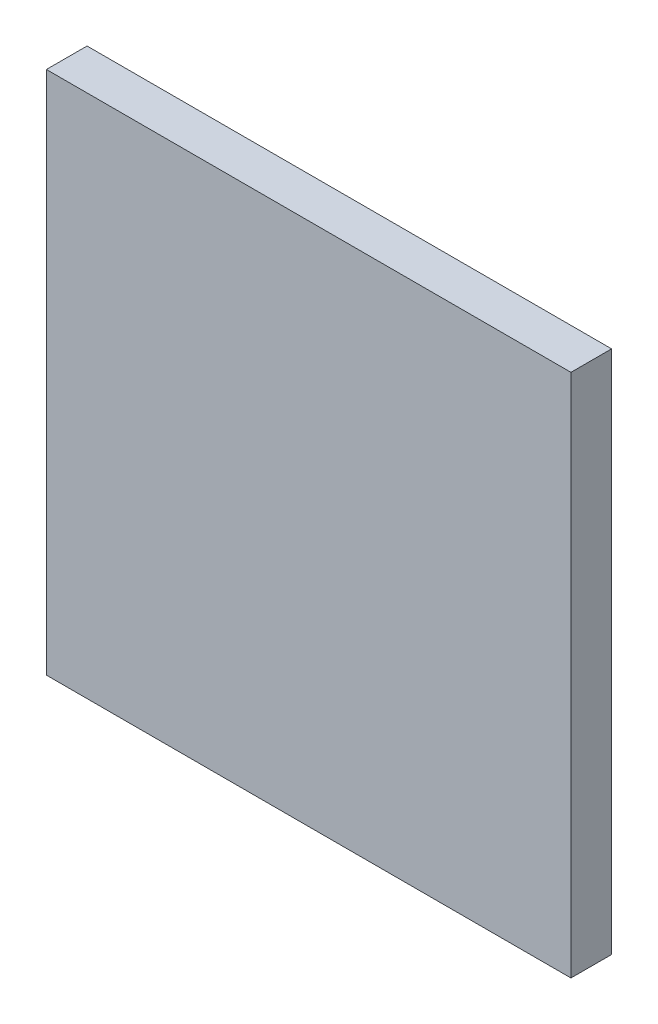
ISO-10303-21;
HEADER;
FILE_DESCRIPTION(('STEP AP214'),'2;1');
FILE_NAME('part.step','',(''),(''),'','','');
FILE_SCHEMA(('AUTOMOTIVE_DESIGN { 1 0 10303 214 1 1 1 1 }'));
ENDSEC;
DATA;
#1=APPLICATION_CONTEXT('core data for automotive mechanical design processes');
#2=APPLICATION_PROTOCOL_DEFINITION('international standard','automotive_design',2000,#1);
#3=PRODUCT_CONTEXT('',#1,'mechanical');
#4=PRODUCT('Part','Part','',(#3));
#5=PRODUCT_RELATED_PRODUCT_CATEGORY('part','',(#4));
#6=PRODUCT_DEFINITION_FORMATION('','',#4);
#7=PRODUCT_DEFINITION_CONTEXT('part definition',#1,'design');
#8=PRODUCT_DEFINITION('design','',#6,#7);
#9=PRODUCT_DEFINITION_SHAPE('','',#8);
#10=(LENGTH_UNIT() NAMED_UNIT(*) SI_UNIT(.MILLI.,.METRE.));
#11=(NAMED_UNIT(*) PLANE_ANGLE_UNIT() SI_UNIT($,.RADIAN.));
#12=(NAMED_UNIT(*) SI_UNIT($,.STERADIAN.) SOLID_ANGLE_UNIT());
#13=UNCERTAINTY_MEASURE_WITH_UNIT(LENGTH_MEASURE(1.E-05),#10,'distance_accuracy_value','');
#14=(GEOMETRIC_REPRESENTATION_CONTEXT(3) GLOBAL_UNCERTAINTY_ASSIGNED_CONTEXT((#13)) GLOBAL_UNIT_ASSIGNED_CONTEXT((#10,
#11,#12)) REPRESENTATION_CONTEXT('',''));
#15=CARTESIAN_POINT('',(0.,0.,0.));
#16=DIRECTION('',(0.,0.,1.));
#17=DIRECTION('',(1.,0.,0.));
#18=AXIS2_PLACEMENT_3D('',#15,#16,#17);
#19=CARTESIAN_POINT('',(-10.00000032,-10.00000032,1.54999944));
#20=DIRECTION('',(0.,0.,1.));
#21=DIRECTION('',(1.,0.,0.));
#22=AXIS2_PLACEMENT_3D('',#19,#20,#21);
#23=PLANE('',#22);
#24=DIRECTION('',(1.,0.,0.));
#25=VECTOR('',#24,1.);
#26=CARTESIAN_POINT('',(-10.00000032,10.00000032,1.54999944));
#27=LINE('',#26,#25);
#28=CARTESIAN_POINT('',(-10.00000032,10.00000032,1.54999944));
#29=VERTEX_POINT('',#28);
#30=CARTESIAN_POINT('',(10.00000032,10.00000032,1.54999944));
#31=VERTEX_POINT('',#30);
#32=EDGE_CURVE('E53',#29,#31,#27,.T.);
#33=ORIENTED_EDGE('',*,*,#32,.F.);
#34=DIRECTION('',(0.,1.,0.));
#35=VECTOR('',#34,1.);
#36=CARTESIAN_POINT('',(-10.00000032,-10.00000032,1.54999944));
#37=LINE('',#36,#35);
#38=CARTESIAN_POINT('',(-10.00000032,-10.00000032,1.54999944));
#39=VERTEX_POINT('',#38);
#40=EDGE_CURVE('E68',#39,#29,#37,.T.);
#41=ORIENTED_EDGE('',*,*,#40,.F.);
#42=DIRECTION('',(1.,0.,0.));
#43=VECTOR('',#42,1.);
#44=CARTESIAN_POINT('',(10.00000032,-10.00000032,1.54999944));
#45=LINE('',#44,#43);
#46=CARTESIAN_POINT('',(10.00000032,-10.00000032,1.54999944));
#47=VERTEX_POINT('',#46);
#48=EDGE_CURVE('E20',#47,#39,#45,.F.);
#49=ORIENTED_EDGE('',*,*,#48,.F.);
#50=DIRECTION('',(0.,1.,0.));
#51=VECTOR('',#50,1.);
#52=CARTESIAN_POINT('',(10.00000032,10.00000032,1.54999944));
#53=LINE('',#52,#51);
#54=EDGE_CURVE('E58',#31,#47,#53,.F.);
#55=ORIENTED_EDGE('',*,*,#54,.F.);
#56=EDGE_LOOP('',(#33,#41,#49,#55));
#57=FACE_BOUND('',#56,.T.);
#58=ADVANCED_FACE('F17',(#57),#23,.T.);
#59=CARTESIAN_POINT('',(10.00000032,-10.00000032,0.));
#60=DIRECTION('',(0.,-1.,0.));
#61=DIRECTION('',(0.,0.,-1.));
#62=AXIS2_PLACEMENT_3D('',#59,#60,#61);
#63=PLANE('',#62);
#64=DIRECTION('',(0.,0.,1.));
#65=VECTOR('',#64,1.);
#66=CARTESIAN_POINT('',(-10.00000032,-10.00000032,0.));
#67=LINE('',#66,#65);
#68=CARTESIAN_POINT('',(-10.00000032,-10.00000032,0.));
#69=VERTEX_POINT('',#68);
#70=EDGE_CURVE('E79',#69,#39,#67,.T.);
#71=ORIENTED_EDGE('',*,*,#70,.F.);
#72=DIRECTION('',(1.,0.,0.));
#73=VECTOR('',#72,1.);
#74=CARTESIAN_POINT('',(-10.00000032,-10.00000032,0.));
#75=LINE('',#74,#73);
#76=CARTESIAN_POINT('',(10.00000032,-10.00000032,0.));
#77=VERTEX_POINT('',#76);
#78=EDGE_CURVE('E74',#69,#77,#75,.T.);
#79=ORIENTED_EDGE('',*,*,#78,.T.);
#80=DIRECTION('',(0.,0.,-1.));
#81=VECTOR('',#80,1.);
#82=CARTESIAN_POINT('',(10.00000032,-10.00000032,0.));
#83=LINE('',#82,#81);
#84=EDGE_CURVE('E63',#47,#77,#83,.T.);
#85=ORIENTED_EDGE('',*,*,#84,.F.);
#86=ORIENTED_EDGE('',*,*,#48,.T.);
#87=EDGE_LOOP('',(#71,#79,#85,#86));
#88=FACE_BOUND('',#87,.T.);
#89=ADVANCED_FACE('F73',(#88),#63,.T.);
#90=CARTESIAN_POINT('',(10.00000032,10.00000032,0.));
#91=DIRECTION('',(1.,0.,0.));
#92=DIRECTION('',(0.,0.,-1.));
#93=AXIS2_PLACEMENT_3D('',#90,#91,#92);
#94=PLANE('',#93);
#95=ORIENTED_EDGE('',*,*,#84,.T.);
#96=DIRECTION('',(0.,1.,0.));
#97=VECTOR('',#96,1.);
#98=CARTESIAN_POINT('',(10.00000032,-10.00000032,0.));
#99=LINE('',#98,#97);
#100=CARTESIAN_POINT('',(10.00000032,10.00000032,0.));
#101=VERTEX_POINT('',#100);
#102=EDGE_CURVE('E84',#77,#101,#99,.T.);
#103=ORIENTED_EDGE('',*,*,#102,.T.);
#104=DIRECTION('',(0.,0.,1.));
#105=VECTOR('',#104,1.);
#106=CARTESIAN_POINT('',(10.00000032,10.00000032,0.));
#107=LINE('',#106,#105);
#108=EDGE_CURVE('E65',#31,#101,#107,.F.);
#109=ORIENTED_EDGE('',*,*,#108,.F.);
#110=ORIENTED_EDGE('',*,*,#54,.T.);
#111=EDGE_LOOP('',(#95,#103,#109,#110));
#112=FACE_BOUND('',#111,.T.);
#113=ADVANCED_FACE('F60',(#112),#94,.T.);
#114=CARTESIAN_POINT('',(-10.00000032,10.00000032,0.));
#115=DIRECTION('',(0.,1.,0.));
#116=DIRECTION('',(0.,0.,1.));
#117=AXIS2_PLACEMENT_3D('',#114,#115,#116);
#118=PLANE('',#117);
#119=ORIENTED_EDGE('',*,*,#108,.T.);
#120=DIRECTION('',(1.,0.,0.));
#121=VECTOR('',#120,1.);
#122=CARTESIAN_POINT('',(-10.00000032,10.00000032,0.));
#123=LINE('',#122,#121);
#124=CARTESIAN_POINT('',(-10.00000032,10.00000032,0.));
#125=VERTEX_POINT('',#124);
#126=EDGE_CURVE('E26',#101,#125,#123,.F.);
#127=ORIENTED_EDGE('',*,*,#126,.T.);
#128=DIRECTION('',(0.,0.,1.));
#129=VECTOR('',#128,1.);
#130=CARTESIAN_POINT('',(-10.00000032,10.00000032,0.));
#131=LINE('',#130,#129);
#132=EDGE_CURVE('E34',#29,#125,#131,.F.);
#133=ORIENTED_EDGE('',*,*,#132,.F.);
#134=ORIENTED_EDGE('',*,*,#32,.T.);
#135=EDGE_LOOP('',(#119,#127,#133,#134));
#136=FACE_BOUND('',#135,.T.);
#137=ADVANCED_FACE('F88',(#136),#118,.T.);
#138=CARTESIAN_POINT('',(-10.00000032,-10.00000032,0.));
#139=DIRECTION('',(-1.,0.,0.));
#140=DIRECTION('',(0.,0.,1.));
#141=AXIS2_PLACEMENT_3D('',#138,#139,#140);
#142=PLANE('',#141);
#143=ORIENTED_EDGE('',*,*,#132,.T.);
#144=DIRECTION('',(0.,1.,0.));
#145=VECTOR('',#144,1.);
#146=CARTESIAN_POINT('',(-10.00000032,-10.00000032,0.));
#147=LINE('',#146,#145);
#148=EDGE_CURVE('E11',#125,#69,#147,.F.);
#149=ORIENTED_EDGE('',*,*,#148,.T.);
#150=ORIENTED_EDGE('',*,*,#70,.T.);
#151=ORIENTED_EDGE('',*,*,#40,.T.);
#152=EDGE_LOOP('',(#143,#149,#150,#151));
#153=FACE_BOUND('',#152,.T.);
#154=ADVANCED_FACE('F91',(#153),#142,.T.);
#155=CARTESIAN_POINT('',(-10.00000032,-10.00000032,0.));
#156=DIRECTION('',(0.,0.,1.));
#157=DIRECTION('',(1.,0.,0.));
#158=AXIS2_PLACEMENT_3D('',#155,#156,#157);
#159=PLANE('',#158);
#160=ORIENTED_EDGE('',*,*,#126,.F.);
#161=ORIENTED_EDGE('',*,*,#102,.F.);
#162=ORIENTED_EDGE('',*,*,#78,.F.);
#163=ORIENTED_EDGE('',*,*,#148,.F.);
#164=EDGE_LOOP('',(#160,#161,#162,#163));
#165=FACE_BOUND('',#164,.T.);
#166=ADVANCED_FACE('F90',(#165),#159,.F.);
#167=CLOSED_SHELL('',(#58,#89,#113,#137,#154,#166));
#168=MANIFOLD_SOLID_BREP('B1',#167);
#169=ADVANCED_BREP_SHAPE_REPRESENTATION('',(#18,#168),#14);
#170=SHAPE_DEFINITION_REPRESENTATION(#9,#169);
ENDSEC;
END-ISO-10303-21;
